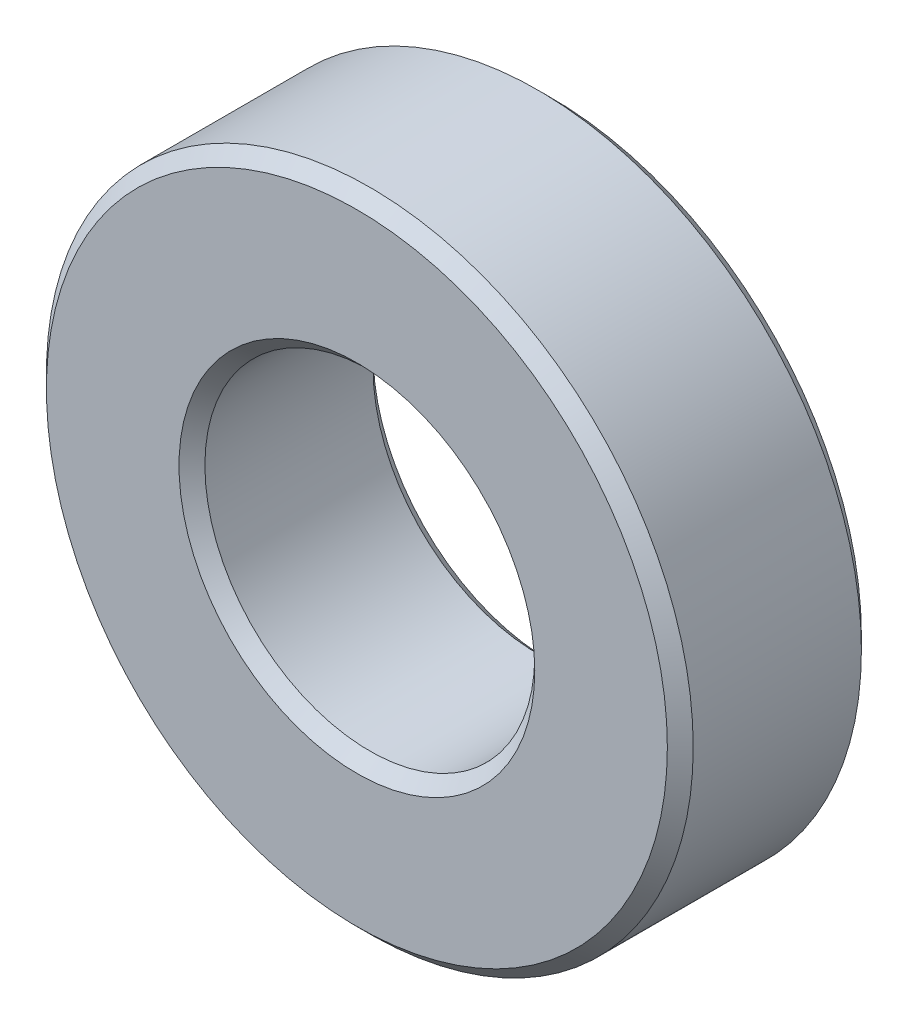
ISO-10303-21;
HEADER;
FILE_DESCRIPTION(('STEP AP214'),'2;1');
FILE_NAME('part.step','',(''),(''),'','','');
FILE_SCHEMA(('AUTOMOTIVE_DESIGN { 1 0 10303 214 1 1 1 1 }'));
ENDSEC;
DATA;
#1=APPLICATION_CONTEXT('core data for automotive mechanical design processes');
#2=APPLICATION_PROTOCOL_DEFINITION('international standard','automotive_design',2000,#1);
#3=PRODUCT_CONTEXT('',#1,'mechanical');
#4=PRODUCT('Part','Part','',(#3));
#5=PRODUCT_RELATED_PRODUCT_CATEGORY('part','',(#4));
#6=PRODUCT_DEFINITION_FORMATION('','',#4);
#7=PRODUCT_DEFINITION_CONTEXT('part definition',#1,'design');
#8=PRODUCT_DEFINITION('design','',#6,#7);
#9=PRODUCT_DEFINITION_SHAPE('','',#8);
#10=(LENGTH_UNIT() NAMED_UNIT(*) SI_UNIT(.MILLI.,.METRE.));
#11=(NAMED_UNIT(*) PLANE_ANGLE_UNIT() SI_UNIT($,.RADIAN.));
#12=(NAMED_UNIT(*) SI_UNIT($,.STERADIAN.) SOLID_ANGLE_UNIT());
#13=UNCERTAINTY_MEASURE_WITH_UNIT(LENGTH_MEASURE(1.E-05),#10,'distance_accuracy_value','');
#14=(GEOMETRIC_REPRESENTATION_CONTEXT(3) GLOBAL_UNCERTAINTY_ASSIGNED_CONTEXT((#13)) GLOBAL_UNIT_ASSIGNED_CONTEXT((#10,
#11,#12)) REPRESENTATION_CONTEXT('',''));
#15=CARTESIAN_POINT('',(0.,0.,0.));
#16=DIRECTION('',(0.,0.,1.));
#17=DIRECTION('',(1.,0.,0.));
#18=AXIS2_PLACEMENT_3D('',#15,#16,#17);
#19=CARTESIAN_POINT('',(0.,0.,3.));
#20=DIRECTION('',(0.,0.,1.));
#21=DIRECTION('',(1.,0.,0.));
#22=AXIS2_PLACEMENT_3D('',#19,#20,#21);
#23=PLANE('',#22);
#24=CARTESIAN_POINT('',(0.,0.,3.));
#25=DIRECTION('',(0.,0.,1.));
#26=DIRECTION('',(1.,0.,0.));
#27=AXIS2_PLACEMENT_3D('',#24,#25,#26);
#28=CIRCLE('',#27,2.75);
#29=CARTESIAN_POINT('',(2.75,0.,3.));
#30=VERTEX_POINT('',#29);
#31=EDGE_CURVE('E10',#30,#30,#28,.F.);
#32=ORIENTED_EDGE('',*,*,#31,.T.);
#33=EDGE_LOOP('',(#32));
#34=FACE_BOUND('',#33,.T.);
#35=CARTESIAN_POINT('',(0.,0.,3.));
#36=DIRECTION('',(0.,0.,1.));
#37=DIRECTION('',(1.,0.,0.));
#38=AXIS2_PLACEMENT_3D('',#35,#36,#37);
#39=CIRCLE('',#38,4.8);
#40=CARTESIAN_POINT('',(4.8,0.,3.));
#41=VERTEX_POINT('',#40);
#42=EDGE_CURVE('E37',#41,#41,#39,.T.);
#43=ORIENTED_EDGE('',*,*,#42,.T.);
#44=EDGE_LOOP('',(#43));
#45=FACE_BOUND('',#44,.T.);
#46=ADVANCED_FACE('F30',(#34,#45),#23,.T.);
#47=CARTESIAN_POINT('',(0.,0.,0.));
#48=DIRECTION('',(0.,0.,1.));
#49=DIRECTION('',(1.,0.,0.));
#50=AXIS2_PLACEMENT_3D('',#47,#48,#49);
#51=PLANE('',#50);
#52=CARTESIAN_POINT('',(0.,0.,0.));
#53=DIRECTION('',(0.,0.,1.));
#54=DIRECTION('',(1.,0.,0.));
#55=AXIS2_PLACEMENT_3D('',#52,#53,#54);
#56=CIRCLE('',#55,4.8);
#57=CARTESIAN_POINT('',(4.8,0.,0.));
#58=VERTEX_POINT('',#57);
#59=EDGE_CURVE('E50',#58,#58,#56,.F.);
#60=ORIENTED_EDGE('',*,*,#59,.T.);
#61=EDGE_LOOP('',(#60));
#62=FACE_BOUND('',#61,.T.);
#63=CARTESIAN_POINT('',(0.,0.,0.));
#64=DIRECTION('',(0.,0.,1.));
#65=DIRECTION('',(1.,0.,0.));
#66=AXIS2_PLACEMENT_3D('',#63,#64,#65);
#67=CIRCLE('',#66,2.75);
#68=CARTESIAN_POINT('',(2.75,0.,0.));
#69=VERTEX_POINT('',#68);
#70=EDGE_CURVE('E53',#69,#69,#67,.T.);
#71=ORIENTED_EDGE('',*,*,#70,.T.);
#72=EDGE_LOOP('',(#71));
#73=FACE_BOUND('',#72,.T.);
#74=ADVANCED_FACE('F74',(#62,#73),#51,.F.);
#75=CARTESIAN_POINT('',(0.,0.,3.));
#76=DIRECTION('',(0.,0.,-1.));
#77=DIRECTION('',(-1.,0.,0.));
#78=AXIS2_PLACEMENT_3D('',#75,#76,#77);
#79=CYLINDRICAL_SURFACE('',#78,5.);
#80=CARTESIAN_POINT('',(0.,0.,0.200000000000006));
#81=DIRECTION('',(0.,0.,1.));
#82=DIRECTION('',(1.,0.,0.));
#83=AXIS2_PLACEMENT_3D('',#80,#81,#82);
#84=CIRCLE('',#83,5.);
#85=CARTESIAN_POINT('',(5.,0.,0.200000000000006));
#86=VERTEX_POINT('',#85);
#87=EDGE_CURVE('E56',#86,#86,#84,.T.);
#88=ORIENTED_EDGE('',*,*,#87,.T.);
#89=EDGE_LOOP('',(#88));
#90=FACE_BOUND('',#89,.T.);
#91=CARTESIAN_POINT('',(0.,0.,2.8));
#92=DIRECTION('',(0.,0.,1.));
#93=DIRECTION('',(1.,0.,0.));
#94=AXIS2_PLACEMENT_3D('',#91,#92,#93);
#95=CIRCLE('',#94,5.);
#96=CARTESIAN_POINT('',(5.,0.,2.8));
#97=VERTEX_POINT('',#96);
#98=EDGE_CURVE('E59',#97,#97,#95,.F.);
#99=ORIENTED_EDGE('',*,*,#98,.T.);
#100=EDGE_LOOP('',(#99));
#101=FACE_BOUND('',#100,.T.);
#102=ADVANCED_FACE('F63',(#90,#101),#79,.T.);
#103=CARTESIAN_POINT('',(0.,0.,3.));
#104=DIRECTION('',(0.,0.,-1.));
#105=DIRECTION('',(-1.,0.,0.));
#106=AXIS2_PLACEMENT_3D('',#103,#104,#105);
#107=CYLINDRICAL_SURFACE('',#106,2.55);
#108=CARTESIAN_POINT('',(0.,0.,0.200000000000006));
#109=DIRECTION('',(0.,0.,1.));
#110=DIRECTION('',(1.,0.,0.));
#111=AXIS2_PLACEMENT_3D('',#108,#109,#110);
#112=CIRCLE('',#111,2.55);
#113=CARTESIAN_POINT('',(2.55,0.,0.200000000000006));
#114=VERTEX_POINT('',#113);
#115=EDGE_CURVE('E41',#114,#114,#112,.F.);
#116=ORIENTED_EDGE('',*,*,#115,.T.);
#117=EDGE_LOOP('',(#116));
#118=FACE_BOUND('',#117,.T.);
#119=CARTESIAN_POINT('',(0.,0.,2.8));
#120=DIRECTION('',(0.,0.,1.));
#121=DIRECTION('',(1.,0.,0.));
#122=AXIS2_PLACEMENT_3D('',#119,#120,#121);
#123=CIRCLE('',#122,2.55);
#124=CARTESIAN_POINT('',(2.55,0.,2.8));
#125=VERTEX_POINT('',#124);
#126=EDGE_CURVE('E45',#125,#125,#123,.T.);
#127=ORIENTED_EDGE('',*,*,#126,.T.);
#128=EDGE_LOOP('',(#127));
#129=FACE_BOUND('',#128,.T.);
#130=ADVANCED_FACE('F82',(#118,#129),#107,.F.);
#131=CARTESIAN_POINT('',(0.,0.,0.200000000000006));
#132=DIRECTION('',(0.,0.,1.));
#133=DIRECTION('',(1.,0.,0.));
#134=AXIS2_PLACEMENT_3D('',#131,#132,#133);
#135=CONICAL_SURFACE('',#134,5.,0.785398163397448);
#136=ORIENTED_EDGE('',*,*,#59,.F.);
#137=EDGE_LOOP('',(#136));
#138=FACE_BOUND('',#137,.T.);
#139=ORIENTED_EDGE('',*,*,#87,.F.);
#140=EDGE_LOOP('',(#139));
#141=FACE_BOUND('',#140,.T.);
#142=ADVANCED_FACE('F87',(#138,#141),#135,.T.);
#143=CARTESIAN_POINT('',(0.,0.,0.));
#144=DIRECTION('',(0.,0.,-1.));
#145=DIRECTION('',(-1.,0.,0.));
#146=AXIS2_PLACEMENT_3D('',#143,#144,#145);
#147=CONICAL_SURFACE('',#146,2.75,0.785398163397445);
#148=ORIENTED_EDGE('',*,*,#115,.F.);
#149=EDGE_LOOP('',(#148));
#150=FACE_BOUND('',#149,.T.);
#151=ORIENTED_EDGE('',*,*,#70,.F.);
#152=EDGE_LOOP('',(#151));
#153=FACE_BOUND('',#152,.T.);
#154=ADVANCED_FACE('F71',(#150,#153),#147,.F.);
#155=CARTESIAN_POINT('',(0.,0.,2.8));
#156=DIRECTION('',(0.,0.,1.));
#157=DIRECTION('',(1.,0.,0.));
#158=AXIS2_PLACEMENT_3D('',#155,#156,#157);
#159=CONICAL_SURFACE('',#158,2.55,0.785398163397449);
#160=ORIENTED_EDGE('',*,*,#31,.F.);
#161=EDGE_LOOP('',(#160));
#162=FACE_BOUND('',#161,.T.);
#163=ORIENTED_EDGE('',*,*,#126,.F.);
#164=EDGE_LOOP('',(#163));
#165=FACE_BOUND('',#164,.T.);
#166=ADVANCED_FACE('F67',(#162,#165),#159,.F.);
#167=CARTESIAN_POINT('',(0.,0.,3.));
#168=DIRECTION('',(0.,0.,-1.));
#169=DIRECTION('',(-1.,0.,0.));
#170=AXIS2_PLACEMENT_3D('',#167,#168,#169);
#171=CONICAL_SURFACE('',#170,4.8,0.785398163397446);
#172=ORIENTED_EDGE('',*,*,#98,.F.);
#173=EDGE_LOOP('',(#172));
#174=FACE_BOUND('',#173,.T.);
#175=ORIENTED_EDGE('',*,*,#42,.F.);
#176=EDGE_LOOP('',(#175));
#177=FACE_BOUND('',#176,.T.);
#178=ADVANCED_FACE('F32',(#174,#177),#171,.T.);
#179=CLOSED_SHELL('',(#46,#74,#102,#130,#142,#154,#166,#178));
#180=MANIFOLD_SOLID_BREP('B2',#179);
#181=ADVANCED_BREP_SHAPE_REPRESENTATION('',(#18,#180),#14);
#182=SHAPE_DEFINITION_REPRESENTATION(#9,#181);
ENDSEC;
END-ISO-10303-21;
